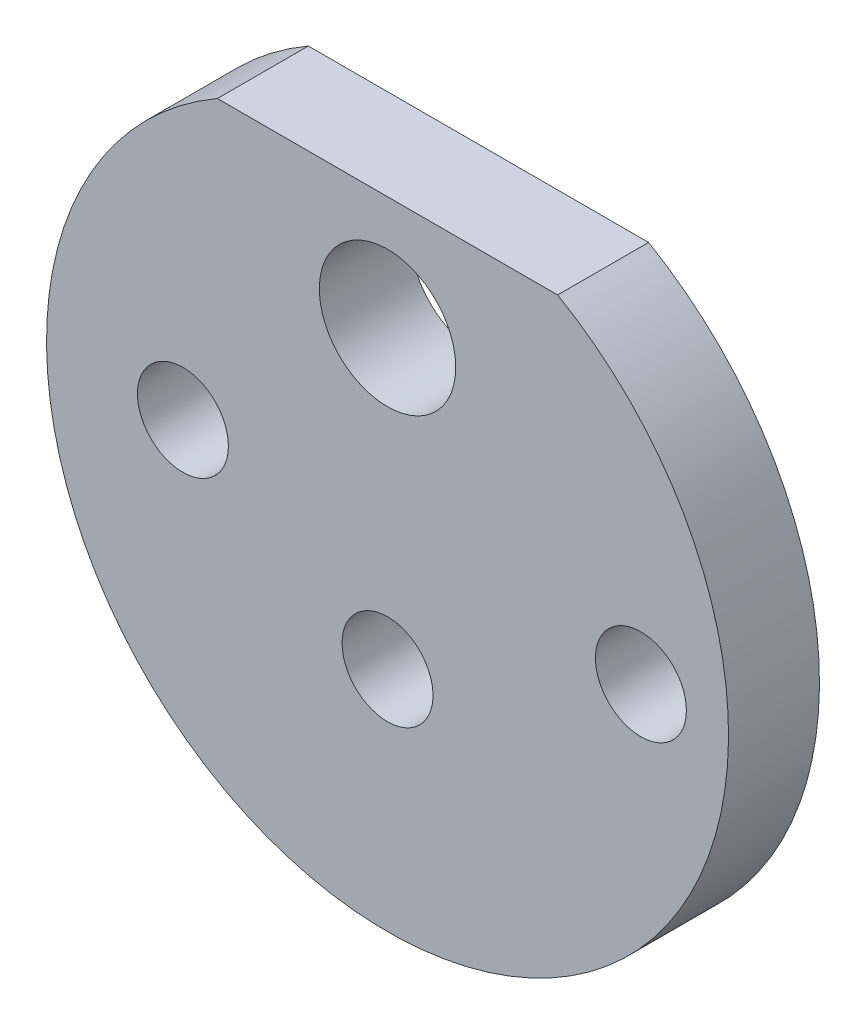
ISO-10303-21;
HEADER;
FILE_DESCRIPTION(('STEP AP214'),'2;1');
FILE_NAME('part.step','',(''),(''),'','','');
FILE_SCHEMA(('AUTOMOTIVE_DESIGN { 1 0 10303 214 1 1 1 1 }'));
ENDSEC;
DATA;
#1=APPLICATION_CONTEXT('core data for automotive mechanical design processes');
#2=APPLICATION_PROTOCOL_DEFINITION('international standard','automotive_design',2000,#1);
#3=PRODUCT_CONTEXT('',#1,'mechanical');
#4=PRODUCT('Part','Part','',(#3));
#5=PRODUCT_RELATED_PRODUCT_CATEGORY('part','',(#4));
#6=PRODUCT_DEFINITION_FORMATION('','',#4);
#7=PRODUCT_DEFINITION_CONTEXT('part definition',#1,'design');
#8=PRODUCT_DEFINITION('design','',#6,#7);
#9=PRODUCT_DEFINITION_SHAPE('','',#8);
#10=(LENGTH_UNIT() NAMED_UNIT(*) SI_UNIT(.MILLI.,.METRE.));
#11=(NAMED_UNIT(*) PLANE_ANGLE_UNIT() SI_UNIT($,.RADIAN.));
#12=(NAMED_UNIT(*) SI_UNIT($,.STERADIAN.) SOLID_ANGLE_UNIT());
#13=UNCERTAINTY_MEASURE_WITH_UNIT(LENGTH_MEASURE(1.E-05),#10,'distance_accuracy_value','');
#14=(GEOMETRIC_REPRESENTATION_CONTEXT(3) GLOBAL_UNCERTAINTY_ASSIGNED_CONTEXT((#13)) GLOBAL_UNIT_ASSIGNED_CONTEXT((#10,
#11,#12)) REPRESENTATION_CONTEXT('',''));
#15=CARTESIAN_POINT('',(0.,0.,0.));
#16=DIRECTION('',(0.,0.,1.));
#17=DIRECTION('',(1.,0.,0.));
#18=AXIS2_PLACEMENT_3D('',#15,#16,#17);
#19=CARTESIAN_POINT('',(0.,0.,4.));
#20=DIRECTION('',(0.,0.,1.));
#21=DIRECTION('',(1.,0.,0.));
#22=AXIS2_PLACEMENT_3D('',#19,#20,#21);
#23=PLANE('',#22);
#24=CARTESIAN_POINT('',(0.,-5.,4.));
#25=DIRECTION('',(0.,0.,-1.));
#26=DIRECTION('',(-1.,0.,0.));
#27=AXIS2_PLACEMENT_3D('',#24,#25,#26);
#28=CIRCLE('',#27,2.);
#29=CARTESIAN_POINT('',(-2.,-5.,4.));
#30=VERTEX_POINT('',#29);
#31=EDGE_CURVE('E125',#30,#30,#28,.T.);
#32=ORIENTED_EDGE('',*,*,#31,.T.);
#33=EDGE_LOOP('',(#32));
#34=FACE_BOUND('',#33,.T.);
#35=CARTESIAN_POINT('',(-9.,0.,4.));
#36=DIRECTION('',(0.,0.,1.));
#37=DIRECTION('',(1.,0.,0.));
#38=AXIS2_PLACEMENT_3D('',#35,#36,#37);
#39=CIRCLE('',#38,2.);
#40=CARTESIAN_POINT('',(-7.,0.,4.));
#41=VERTEX_POINT('',#40);
#42=EDGE_CURVE('E126',#41,#41,#39,.T.);
#43=ORIENTED_EDGE('',*,*,#42,.F.);
#44=EDGE_LOOP('',(#43));
#45=FACE_BOUND('',#44,.T.);
#46=CARTESIAN_POINT('',(0.,0.,4.));
#47=DIRECTION('',(0.,0.,1.));
#48=DIRECTION('',(1.,0.,0.));
#49=AXIS2_PLACEMENT_3D('',#46,#47,#48);
#50=CIRCLE('',#49,15.);
#51=CARTESIAN_POINT('',(-7.48331477354788,13.,4.));
#52=VERTEX_POINT('',#51);
#53=CARTESIAN_POINT('',(7.48331477354788,13.,4.));
#54=VERTEX_POINT('',#53);
#55=EDGE_CURVE('E82',#52,#54,#50,.T.);
#56=ORIENTED_EDGE('',*,*,#55,.T.);
#57=DIRECTION('',(-1.,0.,0.));
#58=VECTOR('',#57,1.);
#59=CARTESIAN_POINT('',(-7.48331477354788,13.,4.));
#60=LINE('',#59,#58);
#61=EDGE_CURVE('E63',#54,#52,#60,.T.);
#62=ORIENTED_EDGE('',*,*,#61,.T.);
#63=EDGE_LOOP('',(#56,#62));
#64=FACE_BOUND('',#63,.T.);
#65=CARTESIAN_POINT('',(0.,8.,4.));
#66=DIRECTION('',(0.,0.,1.));
#67=DIRECTION('',(1.,0.,0.));
#68=AXIS2_PLACEMENT_3D('',#65,#66,#67);
#69=CIRCLE('',#68,3.);
#70=CARTESIAN_POINT('',(3.,8.,4.));
#71=VERTEX_POINT('',#70);
#72=EDGE_CURVE('E92',#71,#71,#69,.T.);
#73=ORIENTED_EDGE('',*,*,#72,.F.);
#74=EDGE_LOOP('',(#73));
#75=FACE_BOUND('',#74,.T.);
#76=CARTESIAN_POINT('',(11.1449379760274,0.,4.));
#77=DIRECTION('',(0.,0.,1.));
#78=DIRECTION('',(1.,0.,0.));
#79=AXIS2_PLACEMENT_3D('',#76,#77,#78);
#80=CIRCLE('',#79,2.);
#81=CARTESIAN_POINT('',(13.1449379760274,0.,4.));
#82=VERTEX_POINT('',#81);
#83=EDGE_CURVE('E116',#82,#82,#80,.T.);
#84=ORIENTED_EDGE('',*,*,#83,.F.);
#85=EDGE_LOOP('',(#84));
#86=FACE_BOUND('',#85,.T.);
#87=ADVANCED_FACE('F45',(#34,#45,#64,#75,#86),#23,.T.);
#88=CARTESIAN_POINT('',(0.,0.,0.));
#89=DIRECTION('',(0.,0.,1.));
#90=DIRECTION('',(1.,0.,0.));
#91=AXIS2_PLACEMENT_3D('',#88,#89,#90);
#92=PLANE('',#91);
#93=CARTESIAN_POINT('',(0.,-5.,0.));
#94=DIRECTION('',(0.,0.,-1.));
#95=DIRECTION('',(-1.,0.,0.));
#96=AXIS2_PLACEMENT_3D('',#93,#94,#95);
#97=CIRCLE('',#96,6.);
#98=CARTESIAN_POINT('',(-6.,-5.,0.));
#99=VERTEX_POINT('',#98);
#100=EDGE_CURVE('E102',#99,#99,#97,.T.);
#101=ORIENTED_EDGE('',*,*,#100,.F.);
#102=EDGE_LOOP('',(#101));
#103=FACE_BOUND('',#102,.T.);
#104=CARTESIAN_POINT('',(0.,0.,0.));
#105=DIRECTION('',(0.,0.,1.));
#106=DIRECTION('',(1.,0.,0.));
#107=AXIS2_PLACEMENT_3D('',#104,#105,#106);
#108=CIRCLE('',#107,15.);
#109=CARTESIAN_POINT('',(-7.48331477354788,13.,0.));
#110=VERTEX_POINT('',#109);
#111=CARTESIAN_POINT('',(7.48331477354788,13.,0.));
#112=VERTEX_POINT('',#111);
#113=EDGE_CURVE('E83',#110,#112,#108,.T.);
#114=ORIENTED_EDGE('',*,*,#113,.F.);
#115=DIRECTION('',(-1.,0.,0.));
#116=VECTOR('',#115,1.);
#117=CARTESIAN_POINT('',(-7.48331477354788,13.,0.));
#118=LINE('',#117,#116);
#119=EDGE_CURVE('E71',#112,#110,#118,.T.);
#120=ORIENTED_EDGE('',*,*,#119,.F.);
#121=EDGE_LOOP('',(#114,#120));
#122=FACE_BOUND('',#121,.T.);
#123=CARTESIAN_POINT('',(0.,8.,0.));
#124=DIRECTION('',(0.,0.,1.));
#125=DIRECTION('',(1.,0.,0.));
#126=AXIS2_PLACEMENT_3D('',#123,#124,#125);
#127=CIRCLE('',#126,3.);
#128=CARTESIAN_POINT('',(3.,8.,0.));
#129=VERTEX_POINT('',#128);
#130=EDGE_CURVE('E96',#129,#129,#127,.T.);
#131=ORIENTED_EDGE('',*,*,#130,.T.);
#132=EDGE_LOOP('',(#131));
#133=FACE_BOUND('',#132,.T.);
#134=CARTESIAN_POINT('',(-9.,0.,0.));
#135=DIRECTION('',(0.,0.,1.));
#136=DIRECTION('',(1.,0.,0.));
#137=AXIS2_PLACEMENT_3D('',#134,#135,#136);
#138=CIRCLE('',#137,2.);
#139=CARTESIAN_POINT('',(-7.,0.,0.));
#140=VERTEX_POINT('',#139);
#141=EDGE_CURVE('E120',#140,#140,#138,.T.);
#142=ORIENTED_EDGE('',*,*,#141,.T.);
#143=EDGE_LOOP('',(#142));
#144=FACE_BOUND('',#143,.T.);
#145=CARTESIAN_POINT('',(11.1449379760274,0.,0.));
#146=DIRECTION('',(0.,0.,1.));
#147=DIRECTION('',(1.,0.,0.));
#148=AXIS2_PLACEMENT_3D('',#145,#146,#147);
#149=CIRCLE('',#148,2.);
#150=CARTESIAN_POINT('',(13.1449379760274,0.,0.));
#151=VERTEX_POINT('',#150);
#152=EDGE_CURVE('E121',#151,#151,#149,.T.);
#153=ORIENTED_EDGE('',*,*,#152,.T.);
#154=EDGE_LOOP('',(#153));
#155=FACE_BOUND('',#154,.T.);
#156=ADVANCED_FACE('F89',(#103,#122,#133,#144,#155),#92,.F.);
#157=CARTESIAN_POINT('',(0.,0.,4.));
#158=DIRECTION('',(0.,0.,-1.));
#159=DIRECTION('',(-1.,0.,0.));
#160=AXIS2_PLACEMENT_3D('',#157,#158,#159);
#161=CYLINDRICAL_SURFACE('',#160,15.);
#162=ORIENTED_EDGE('',*,*,#113,.T.);
#163=DIRECTION('',(0.,0.,-1.));
#164=VECTOR('',#163,1.);
#165=CARTESIAN_POINT('',(7.48331477354788,13.,4.));
#166=LINE('',#165,#164);
#167=EDGE_CURVE('E79',#54,#112,#166,.T.);
#168=ORIENTED_EDGE('',*,*,#167,.F.);
#169=ORIENTED_EDGE('',*,*,#55,.F.);
#170=DIRECTION('',(0.,0.,-1.));
#171=VECTOR('',#170,1.);
#172=CARTESIAN_POINT('',(-7.48331477354788,13.,4.));
#173=LINE('',#172,#171);
#174=EDGE_CURVE('E76',#52,#110,#173,.T.);
#175=ORIENTED_EDGE('',*,*,#174,.T.);
#176=EDGE_LOOP('',(#162,#168,#169,#175));
#177=FACE_BOUND('',#176,.T.);
#178=ADVANCED_FACE('F86',(#177),#161,.T.);
#179=CARTESIAN_POINT('',(-7.48331477354788,13.,4.));
#180=DIRECTION('',(0.,-1.,0.));
#181=DIRECTION('',(0.,0.,-1.));
#182=AXIS2_PLACEMENT_3D('',#179,#180,#181);
#183=PLANE('',#182);
#184=ORIENTED_EDGE('',*,*,#119,.T.);
#185=ORIENTED_EDGE('',*,*,#174,.F.);
#186=ORIENTED_EDGE('',*,*,#61,.F.);
#187=ORIENTED_EDGE('',*,*,#167,.T.);
#188=EDGE_LOOP('',(#184,#185,#186,#187));
#189=FACE_BOUND('',#188,.T.);
#190=ADVANCED_FACE('F75',(#189),#183,.F.);
#191=CARTESIAN_POINT('',(0.,8.,4.));
#192=DIRECTION('',(0.,0.,-1.));
#193=DIRECTION('',(-1.,0.,0.));
#194=AXIS2_PLACEMENT_3D('',#191,#192,#193);
#195=CYLINDRICAL_SURFACE('',#194,3.);
#196=ORIENTED_EDGE('',*,*,#72,.T.);
#197=EDGE_LOOP('',(#196));
#198=FACE_BOUND('',#197,.T.);
#199=ORIENTED_EDGE('',*,*,#130,.F.);
#200=EDGE_LOOP('',(#199));
#201=FACE_BOUND('',#200,.T.);
#202=ADVANCED_FACE('F162',(#198,#201),#195,.F.);
#203=CARTESIAN_POINT('',(-9.,0.,4.));
#204=DIRECTION('',(0.,0.,-1.));
#205=DIRECTION('',(-1.,0.,0.));
#206=AXIS2_PLACEMENT_3D('',#203,#204,#205);
#207=CYLINDRICAL_SURFACE('',#206,2.);
#208=ORIENTED_EDGE('',*,*,#42,.T.);
#209=EDGE_LOOP('',(#208));
#210=FACE_BOUND('',#209,.T.);
#211=ORIENTED_EDGE('',*,*,#141,.F.);
#212=EDGE_LOOP('',(#211));
#213=FACE_BOUND('',#212,.T.);
#214=ADVANCED_FACE('F149',(#210,#213),#207,.F.);
#215=CARTESIAN_POINT('',(11.1449379760274,0.,4.));
#216=DIRECTION('',(0.,0.,-1.));
#217=DIRECTION('',(-1.,0.,0.));
#218=AXIS2_PLACEMENT_3D('',#215,#216,#217);
#219=CYLINDRICAL_SURFACE('',#218,2.);
#220=ORIENTED_EDGE('',*,*,#83,.T.);
#221=EDGE_LOOP('',(#220));
#222=FACE_BOUND('',#221,.T.);
#223=ORIENTED_EDGE('',*,*,#152,.F.);
#224=EDGE_LOOP('',(#223));
#225=FACE_BOUND('',#224,.T.);
#226=ADVANCED_FACE('F145',(#222,#225),#219,.F.);
#227=CARTESIAN_POINT('',(0.,-5.,-4.));
#228=DIRECTION('',(0.,0.,1.));
#229=DIRECTION('',(1.,0.,0.));
#230=AXIS2_PLACEMENT_3D('',#227,#228,#229);
#231=CYLINDRICAL_SURFACE('',#230,6.);
#232=CARTESIAN_POINT('',(0.,-5.,-3.5));
#233=DIRECTION('',(0.,0.,-1.));
#234=DIRECTION('',(-1.,0.,0.));
#235=AXIS2_PLACEMENT_3D('',#232,#233,#234);
#236=CIRCLE('',#235,6.);
#237=CARTESIAN_POINT('',(-6.,-5.,-3.5));
#238=VERTEX_POINT('',#237);
#239=EDGE_CURVE('E11',#238,#238,#236,.F.);
#240=ORIENTED_EDGE('',*,*,#239,.T.);
#241=EDGE_LOOP('',(#240));
#242=FACE_BOUND('',#241,.T.);
#243=ORIENTED_EDGE('',*,*,#100,.T.);
#244=EDGE_LOOP('',(#243));
#245=FACE_BOUND('',#244,.T.);
#246=ADVANCED_FACE('F148',(#242,#245),#231,.T.);
#247=CARTESIAN_POINT('',(0.,-5.,-4.));
#248=DIRECTION('',(0.,0.,-1.));
#249=DIRECTION('',(-1.,0.,0.));
#250=AXIS2_PLACEMENT_3D('',#247,#248,#249);
#251=PLANE('',#250);
#252=CARTESIAN_POINT('',(0.,-5.,-4.));
#253=DIRECTION('',(0.,0.,-1.));
#254=DIRECTION('',(-1.,0.,0.));
#255=AXIS2_PLACEMENT_3D('',#252,#253,#254);
#256=CIRCLE('',#255,5.50000000000001);
#257=CARTESIAN_POINT('',(-5.50000000000001,-5.,-4.));
#258=VERTEX_POINT('',#257);
#259=EDGE_CURVE('E56',#258,#258,#256,.T.);
#260=ORIENTED_EDGE('',*,*,#259,.T.);
#261=EDGE_LOOP('',(#260));
#262=FACE_BOUND('',#261,.T.);
#263=CARTESIAN_POINT('',(0.,-5.,-4.));
#264=DIRECTION('',(0.,0.,-1.));
#265=DIRECTION('',(-1.,0.,0.));
#266=AXIS2_PLACEMENT_3D('',#263,#264,#265);
#267=CIRCLE('',#266,2.);
#268=CARTESIAN_POINT('',(-2.,-5.,-4.));
#269=VERTEX_POINT('',#268);
#270=EDGE_CURVE('E114',#269,#269,#267,.T.);
#271=ORIENTED_EDGE('',*,*,#270,.F.);
#272=EDGE_LOOP('',(#271));
#273=FACE_BOUND('',#272,.T.);
#274=ADVANCED_FACE('F176',(#262,#273),#251,.T.);
#275=CARTESIAN_POINT('',(0.,-5.,4.));
#276=DIRECTION('',(0.,0.,-1.));
#277=DIRECTION('',(-1.,0.,0.));
#278=AXIS2_PLACEMENT_3D('',#275,#276,#277);
#279=CYLINDRICAL_SURFACE('',#278,2.);
#280=ORIENTED_EDGE('',*,*,#31,.F.);
#281=EDGE_LOOP('',(#280));
#282=FACE_BOUND('',#281,.T.);
#283=ORIENTED_EDGE('',*,*,#270,.T.);
#284=EDGE_LOOP('',(#283));
#285=FACE_BOUND('',#284,.T.);
#286=ADVANCED_FACE('F180',(#282,#285),#279,.F.);
#287=CARTESIAN_POINT('',(0.,-5.,-4.));
#288=DIRECTION('',(0.,0.,1.));
#289=DIRECTION('',(1.,0.,0.));
#290=AXIS2_PLACEMENT_3D('',#287,#288,#289);
#291=CONICAL_SURFACE('',#290,5.50000000000001,0.785398163397447);
#292=ORIENTED_EDGE('',*,*,#239,.F.);
#293=EDGE_LOOP('',(#292));
#294=FACE_BOUND('',#293,.T.);
#295=ORIENTED_EDGE('',*,*,#259,.F.);
#296=EDGE_LOOP('',(#295));
#297=FACE_BOUND('',#296,.T.);
#298=ADVANCED_FACE('F48',(#294,#297),#291,.T.);
#299=CLOSED_SHELL('',(#87,#156,#178,#190,#202,#214,#226,#246,#274,#286,#298));
#300=MANIFOLD_SOLID_BREP('B2',#299);
#301=ADVANCED_BREP_SHAPE_REPRESENTATION('',(#18,#300),#14);
#302=SHAPE_DEFINITION_REPRESENTATION(#9,#301);
ENDSEC;
END-ISO-10303-21;
